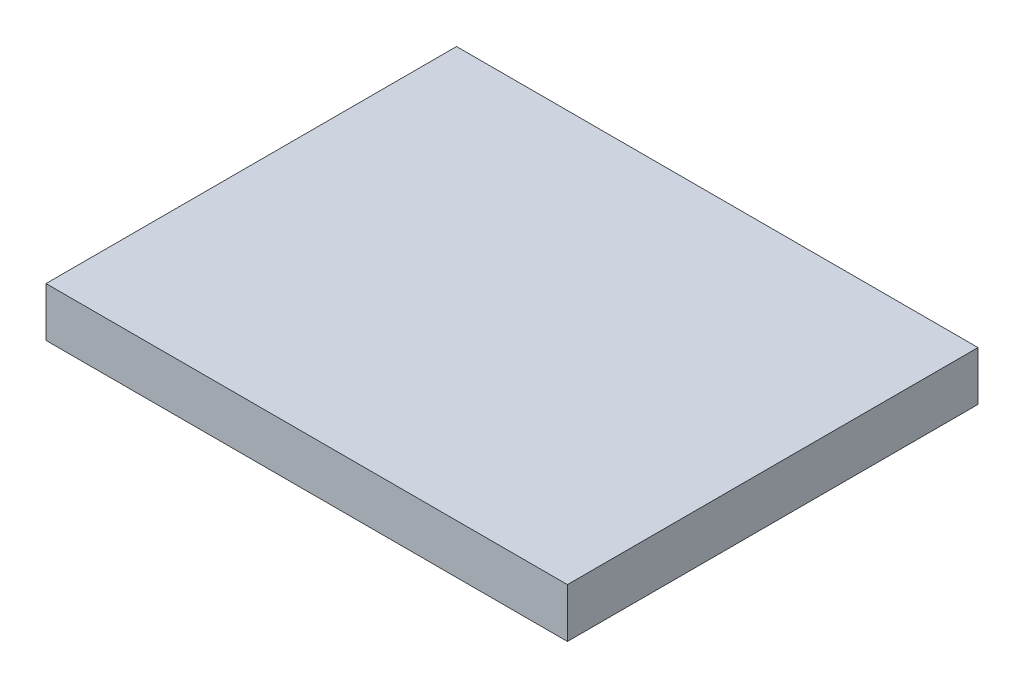
ISO-10303-21;
HEADER;
FILE_DESCRIPTION(('STEP AP214'),'2;1');
FILE_NAME('part.step','',(''),(''),'','','');
FILE_SCHEMA(('AUTOMOTIVE_DESIGN { 1 0 10303 214 1 1 1 1 }'));
ENDSEC;
DATA;
#1=APPLICATION_CONTEXT('core data for automotive mechanical design processes');
#2=APPLICATION_PROTOCOL_DEFINITION('international standard','automotive_design',2000,#1);
#3=PRODUCT_CONTEXT('',#1,'mechanical');
#4=PRODUCT('Part','Part','',(#3));
#5=PRODUCT_RELATED_PRODUCT_CATEGORY('part','',(#4));
#6=PRODUCT_DEFINITION_FORMATION('','',#4);
#7=PRODUCT_DEFINITION_CONTEXT('part definition',#1,'design');
#8=PRODUCT_DEFINITION('design','',#6,#7);
#9=PRODUCT_DEFINITION_SHAPE('','',#8);
#10=(LENGTH_UNIT() NAMED_UNIT(*) SI_UNIT(.MILLI.,.METRE.));
#11=(NAMED_UNIT(*) PLANE_ANGLE_UNIT() SI_UNIT($,.RADIAN.));
#12=(NAMED_UNIT(*) SI_UNIT($,.STERADIAN.) SOLID_ANGLE_UNIT());
#13=UNCERTAINTY_MEASURE_WITH_UNIT(LENGTH_MEASURE(1.E-05),#10,'distance_accuracy_value','');
#14=(GEOMETRIC_REPRESENTATION_CONTEXT(3) GLOBAL_UNCERTAINTY_ASSIGNED_CONTEXT((#13)) GLOBAL_UNIT_ASSIGNED_CONTEXT((#10,
#11,#12)) REPRESENTATION_CONTEXT('',''));
#15=CARTESIAN_POINT('',(0.,0.,0.));
#16=DIRECTION('',(0.,0.,1.));
#17=DIRECTION('',(1.,0.,0.));
#18=AXIS2_PLACEMENT_3D('',#15,#16,#17);
#19=CARTESIAN_POINT('',(15.875,3.,12.5));
#20=DIRECTION('',(-1.,0.,0.));
#21=DIRECTION('',(0.,0.,1.));
#22=AXIS2_PLACEMENT_3D('',#19,#20,#21);
#23=PLANE('',#22);
#24=DIRECTION('',(0.,0.,-1.));
#25=VECTOR('',#24,1.);
#26=CARTESIAN_POINT('',(15.875,0.,12.5));
#27=LINE('',#26,#25);
#28=CARTESIAN_POINT('',(15.875,0.,12.5));
#29=VERTEX_POINT('',#28);
#30=CARTESIAN_POINT('',(15.875,0.,-12.5));
#31=VERTEX_POINT('',#30);
#32=EDGE_CURVE('E96',#29,#31,#27,.T.);
#33=ORIENTED_EDGE('',*,*,#32,.T.);
#34=DIRECTION('',(0.,-1.,0.));
#35=VECTOR('',#34,1.);
#36=CARTESIAN_POINT('',(15.875,3.,-12.5));
#37=LINE('',#36,#35);
#38=CARTESIAN_POINT('',(15.875,3.,-12.5));
#39=VERTEX_POINT('',#38);
#40=EDGE_CURVE('E11',#39,#31,#37,.T.);
#41=ORIENTED_EDGE('',*,*,#40,.F.);
#42=DIRECTION('',(0.,0.,-1.));
#43=VECTOR('',#42,1.);
#44=CARTESIAN_POINT('',(15.875,3.,12.5));
#45=LINE('',#44,#43);
#46=CARTESIAN_POINT('',(15.875,3.,12.5));
#47=VERTEX_POINT('',#46);
#48=EDGE_CURVE('E84',#47,#39,#45,.T.);
#49=ORIENTED_EDGE('',*,*,#48,.F.);
#50=DIRECTION('',(0.,-1.,0.));
#51=VECTOR('',#50,1.);
#52=CARTESIAN_POINT('',(15.875,3.,12.5));
#53=LINE('',#52,#51);
#54=EDGE_CURVE('E92',#47,#29,#53,.T.);
#55=ORIENTED_EDGE('',*,*,#54,.T.);
#56=EDGE_LOOP('',(#33,#41,#49,#55));
#57=FACE_BOUND('',#56,.T.);
#58=ADVANCED_FACE('F33',(#57),#23,.F.);
#59=CARTESIAN_POINT('',(-15.875,3.,-12.5));
#60=DIRECTION('',(0.,0.,1.));
#61=DIRECTION('',(1.,0.,0.));
#62=AXIS2_PLACEMENT_3D('',#59,#60,#61);
#63=PLANE('',#62);
#64=DIRECTION('',(-1.,0.,0.));
#65=VECTOR('',#64,1.);
#66=CARTESIAN_POINT('',(-15.875,0.,-12.5));
#67=LINE('',#66,#65);
#68=CARTESIAN_POINT('',(-15.875,0.,-12.5));
#69=VERTEX_POINT('',#68);
#70=EDGE_CURVE('E88',#31,#69,#67,.T.);
#71=ORIENTED_EDGE('',*,*,#70,.T.);
#72=DIRECTION('',(0.,-1.,0.));
#73=VECTOR('',#72,1.);
#74=CARTESIAN_POINT('',(-15.875,3.,-12.5));
#75=LINE('',#74,#73);
#76=CARTESIAN_POINT('',(-15.875,3.,-12.5));
#77=VERTEX_POINT('',#76);
#78=EDGE_CURVE('E41',#77,#69,#75,.T.);
#79=ORIENTED_EDGE('',*,*,#78,.F.);
#80=DIRECTION('',(-1.,0.,0.));
#81=VECTOR('',#80,1.);
#82=CARTESIAN_POINT('',(-15.875,3.,-12.5));
#83=LINE('',#82,#81);
#84=EDGE_CURVE('E79',#39,#77,#83,.T.);
#85=ORIENTED_EDGE('',*,*,#84,.F.);
#86=ORIENTED_EDGE('',*,*,#40,.T.);
#87=EDGE_LOOP('',(#71,#79,#85,#86));
#88=FACE_BOUND('',#87,.T.);
#89=ADVANCED_FACE('F87',(#88),#63,.F.);
#90=CARTESIAN_POINT('',(-15.875,3.,12.5));
#91=DIRECTION('',(1.,0.,0.));
#92=DIRECTION('',(0.,0.,-1.));
#93=AXIS2_PLACEMENT_3D('',#90,#91,#92);
#94=PLANE('',#93);
#95=DIRECTION('',(0.,0.,1.));
#96=VECTOR('',#95,1.);
#97=CARTESIAN_POINT('',(-15.875,0.,12.5));
#98=LINE('',#97,#96);
#99=CARTESIAN_POINT('',(-15.875,0.,12.5));
#100=VERTEX_POINT('',#99);
#101=EDGE_CURVE('E66',#69,#100,#98,.T.);
#102=ORIENTED_EDGE('',*,*,#101,.T.);
#103=DIRECTION('',(0.,-1.,0.));
#104=VECTOR('',#103,1.);
#105=CARTESIAN_POINT('',(-15.875,3.,12.5));
#106=LINE('',#105,#104);
#107=CARTESIAN_POINT('',(-15.875,3.,12.5));
#108=VERTEX_POINT('',#107);
#109=EDGE_CURVE('E89',#108,#100,#106,.T.);
#110=ORIENTED_EDGE('',*,*,#109,.F.);
#111=DIRECTION('',(0.,0.,1.));
#112=VECTOR('',#111,1.);
#113=CARTESIAN_POINT('',(-15.875,3.,12.5));
#114=LINE('',#113,#112);
#115=EDGE_CURVE('E82',#77,#108,#114,.T.);
#116=ORIENTED_EDGE('',*,*,#115,.F.);
#117=ORIENTED_EDGE('',*,*,#78,.T.);
#118=EDGE_LOOP('',(#102,#110,#116,#117));
#119=FACE_BOUND('',#118,.T.);
#120=ADVANCED_FACE('F90',(#119),#94,.F.);
#121=CARTESIAN_POINT('',(-15.875,3.,12.5));
#122=DIRECTION('',(0.,0.,-1.));
#123=DIRECTION('',(-1.,0.,0.));
#124=AXIS2_PLACEMENT_3D('',#121,#122,#123);
#125=PLANE('',#124);
#126=DIRECTION('',(1.,0.,0.));
#127=VECTOR('',#126,1.);
#128=CARTESIAN_POINT('',(-15.875,0.,12.5));
#129=LINE('',#128,#127);
#130=EDGE_CURVE('E72',#100,#29,#129,.T.);
#131=ORIENTED_EDGE('',*,*,#130,.T.);
#132=ORIENTED_EDGE('',*,*,#54,.F.);
#133=DIRECTION('',(1.,0.,0.));
#134=VECTOR('',#133,1.);
#135=CARTESIAN_POINT('',(-15.875,3.,12.5));
#136=LINE('',#135,#134);
#137=EDGE_CURVE('E49',#108,#47,#136,.T.);
#138=ORIENTED_EDGE('',*,*,#137,.F.);
#139=ORIENTED_EDGE('',*,*,#109,.T.);
#140=EDGE_LOOP('',(#131,#132,#138,#139));
#141=FACE_BOUND('',#140,.T.);
#142=ADVANCED_FACE('F103',(#141),#125,.F.);
#143=CARTESIAN_POINT('',(0.,3.,0.));
#144=DIRECTION('',(0.,-1.,0.));
#145=DIRECTION('',(0.,0.,-1.));
#146=AXIS2_PLACEMENT_3D('',#143,#144,#145);
#147=PLANE('',#146);
#148=ORIENTED_EDGE('',*,*,#48,.T.);
#149=ORIENTED_EDGE('',*,*,#84,.T.);
#150=ORIENTED_EDGE('',*,*,#115,.T.);
#151=ORIENTED_EDGE('',*,*,#137,.T.);
#152=EDGE_LOOP('',(#148,#149,#150,#151));
#153=FACE_BOUND('',#152,.T.);
#154=ADVANCED_FACE('F80',(#153),#147,.F.);
#155=CARTESIAN_POINT('',(0.,0.,0.));
#156=DIRECTION('',(0.,-1.,0.));
#157=DIRECTION('',(0.,0.,-1.));
#158=AXIS2_PLACEMENT_3D('',#155,#156,#157);
#159=PLANE('',#158);
#160=ORIENTED_EDGE('',*,*,#32,.F.);
#161=ORIENTED_EDGE('',*,*,#130,.F.);
#162=ORIENTED_EDGE('',*,*,#101,.F.);
#163=ORIENTED_EDGE('',*,*,#70,.F.);
#164=EDGE_LOOP('',(#160,#161,#162,#163));
#165=FACE_BOUND('',#164,.T.);
#166=ADVANCED_FACE('F106',(#165),#159,.T.);
#167=CLOSED_SHELL('',(#58,#89,#120,#142,#154,#166));
#168=MANIFOLD_SOLID_BREP('B2',#167);
#169=ADVANCED_BREP_SHAPE_REPRESENTATION('',(#18,#168),#14);
#170=SHAPE_DEFINITION_REPRESENTATION(#9,#169);
ENDSEC;
END-ISO-10303-21;
